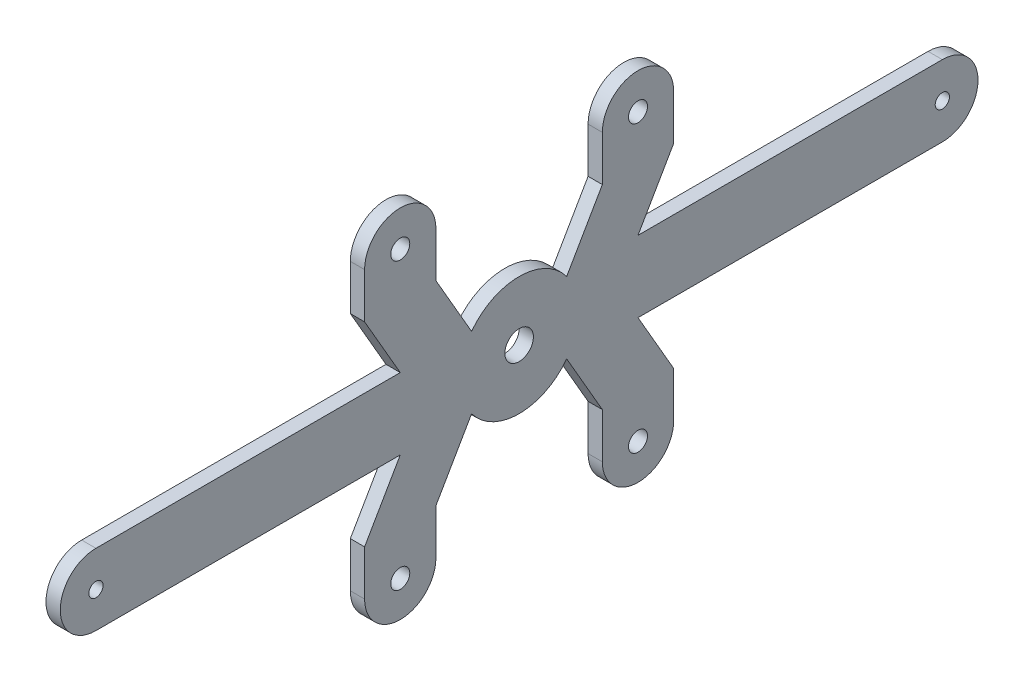
ISO-10303-21;
HEADER;
FILE_DESCRIPTION(('STEP AP214'),'2;1');
FILE_NAME('part.step','',(''),(''),'','','');
FILE_SCHEMA(('AUTOMOTIVE_DESIGN { 1 0 10303 214 1 1 1 1 }'));
ENDSEC;
DATA;
#1=APPLICATION_CONTEXT('core data for automotive mechanical design processes');
#2=APPLICATION_PROTOCOL_DEFINITION('international standard','automotive_design',2000,#1);
#3=PRODUCT_CONTEXT('',#1,'mechanical');
#4=PRODUCT('Part','Part','',(#3));
#5=PRODUCT_RELATED_PRODUCT_CATEGORY('part','',(#4));
#6=PRODUCT_DEFINITION_FORMATION('','',#4);
#7=PRODUCT_DEFINITION_CONTEXT('part definition',#1,'design');
#8=PRODUCT_DEFINITION('design','',#6,#7);
#9=PRODUCT_DEFINITION_SHAPE('','',#8);
#10=(LENGTH_UNIT() NAMED_UNIT(*) SI_UNIT(.MILLI.,.METRE.));
#11=(NAMED_UNIT(*) PLANE_ANGLE_UNIT() SI_UNIT($,.RADIAN.));
#12=(NAMED_UNIT(*) SI_UNIT($,.STERADIAN.) SOLID_ANGLE_UNIT());
#13=UNCERTAINTY_MEASURE_WITH_UNIT(LENGTH_MEASURE(1.E-05),#10,'distance_accuracy_value','');
#14=(GEOMETRIC_REPRESENTATION_CONTEXT(3) GLOBAL_UNCERTAINTY_ASSIGNED_CONTEXT((#13)) GLOBAL_UNIT_ASSIGNED_CONTEXT((#10,
#11,#12)) REPRESENTATION_CONTEXT('',''));
#15=CARTESIAN_POINT('',(0.,0.,0.));
#16=DIRECTION('',(0.,0.,1.));
#17=DIRECTION('',(1.,0.,0.));
#18=AXIS2_PLACEMENT_3D('',#15,#16,#17);
#19=CARTESIAN_POINT('',(3.,0.,0.));
#20=DIRECTION('',(1.,0.,0.));
#21=DIRECTION('',(0.,0.,-1.));
#22=AXIS2_PLACEMENT_3D('',#19,#20,#21);
#23=PLANE('',#22);
#24=CARTESIAN_POINT('',(3.,0.,0.));
#25=DIRECTION('',(1.,0.,0.));
#26=DIRECTION('',(0.,0.,-1.));
#27=AXIS2_PLACEMENT_3D('',#24,#25,#26);
#28=CIRCLE('',#27,3.);
#29=CARTESIAN_POINT('',(3.,0.,-3.));
#30=VERTEX_POINT('',#29);
#31=EDGE_CURVE('E559',#30,#30,#28,.T.);
#32=ORIENTED_EDGE('',*,*,#31,.F.);
#33=EDGE_LOOP('',(#32));
#34=FACE_BOUND('',#33,.T.);
#35=CARTESIAN_POINT('',(3.,30.,25.));
#36=DIRECTION('',(1.,0.,0.));
#37=DIRECTION('',(0.,0.,-1.));
#38=AXIS2_PLACEMENT_3D('',#35,#36,#37);
#39=CIRCLE('',#38,2.00000000000001);
#40=CARTESIAN_POINT('',(3.,30.,23.));
#41=VERTEX_POINT('',#40);
#42=EDGE_CURVE('E156',#41,#41,#39,.T.);
#43=ORIENTED_EDGE('',*,*,#42,.F.);
#44=EDGE_LOOP('',(#43));
#45=FACE_BOUND('',#44,.T.);
#46=CARTESIAN_POINT('',(3.,0.,89.));
#47=DIRECTION('',(1.,0.,0.));
#48=DIRECTION('',(0.,0.,-1.));
#49=AXIS2_PLACEMENT_3D('',#46,#47,#48);
#50=CIRCLE('',#49,1.5);
#51=CARTESIAN_POINT('',(3.,0.,87.5));
#52=VERTEX_POINT('',#51);
#53=EDGE_CURVE('E43',#52,#52,#50,.T.);
#54=ORIENTED_EDGE('',*,*,#53,.F.);
#55=EDGE_LOOP('',(#54));
#56=FACE_BOUND('',#55,.T.);
#57=CARTESIAN_POINT('',(3.,-30.,25.));
#58=DIRECTION('',(-1.,0.,0.));
#59=DIRECTION('',(0.,0.,-1.));
#60=AXIS2_PLACEMENT_3D('',#57,#58,#59);
#61=CIRCLE('',#60,2.00000000000001);
#62=CARTESIAN_POINT('',(3.,-30.,23.));
#63=VERTEX_POINT('',#62);
#64=EDGE_CURVE('E181',#63,#63,#61,.T.);
#65=ORIENTED_EDGE('',*,*,#64,.T.);
#66=EDGE_LOOP('',(#65));
#67=FACE_BOUND('',#66,.T.);
#68=CARTESIAN_POINT('',(3.,0.,-89.));
#69=DIRECTION('',(-1.,0.,0.));
#70=DIRECTION('',(0.,0.,1.));
#71=AXIS2_PLACEMENT_3D('',#68,#69,#70);
#72=CIRCLE('',#71,1.5);
#73=CARTESIAN_POINT('',(3.,0.,-87.5));
#74=VERTEX_POINT('',#73);
#75=EDGE_CURVE('E185',#74,#74,#72,.T.);
#76=ORIENTED_EDGE('',*,*,#75,.T.);
#77=EDGE_LOOP('',(#76));
#78=FACE_BOUND('',#77,.T.);
#79=CARTESIAN_POINT('',(3.,30.,-25.));
#80=DIRECTION('',(-1.,0.,0.));
#81=DIRECTION('',(0.,0.,1.));
#82=AXIS2_PLACEMENT_3D('',#79,#80,#81);
#83=CIRCLE('',#82,2.00000000000001);
#84=CARTESIAN_POINT('',(3.,30.,-23.));
#85=VERTEX_POINT('',#84);
#86=EDGE_CURVE('E189',#85,#85,#83,.T.);
#87=ORIENTED_EDGE('',*,*,#86,.T.);
#88=EDGE_LOOP('',(#87));
#89=FACE_BOUND('',#88,.T.);
#90=CARTESIAN_POINT('',(3.,-30.,-25.));
#91=DIRECTION('',(1.,0.,0.));
#92=DIRECTION('',(0.,0.,1.));
#93=AXIS2_PLACEMENT_3D('',#90,#91,#92);
#94=CIRCLE('',#93,2.00000000000001);
#95=CARTESIAN_POINT('',(3.,-30.,-23.));
#96=VERTEX_POINT('',#95);
#97=EDGE_CURVE('E193',#96,#96,#94,.T.);
#98=ORIENTED_EDGE('',*,*,#97,.F.);
#99=EDGE_LOOP('',(#98));
#100=FACE_BOUND('',#99,.T.);
#101=DIRECTION('',(0.,0.,1.));
#102=VECTOR('',#101,1.);
#103=CARTESIAN_POINT('',(3.,-7.5,-89.));
#104=LINE('',#103,#102);
#105=CARTESIAN_POINT('',(3.,-7.5,-89.));
#106=VERTEX_POINT('',#105);
#107=CARTESIAN_POINT('',(3.,-7.5,-25.));
#108=VERTEX_POINT('',#107);
#109=EDGE_CURVE('E199',#106,#108,#104,.T.);
#110=ORIENTED_EDGE('',*,*,#109,.F.);
#111=CARTESIAN_POINT('',(3.,0.,-89.));
#112=DIRECTION('',(1.,0.,0.));
#113=DIRECTION('',(0.,0.,1.));
#114=AXIS2_PLACEMENT_3D('',#111,#112,#113);
#115=CIRCLE('',#114,7.5);
#116=CARTESIAN_POINT('',(3.,7.5,-89.));
#117=VERTEX_POINT('',#116);
#118=EDGE_CURVE('E203',#106,#117,#115,.T.);
#119=ORIENTED_EDGE('',*,*,#118,.T.);
#120=DIRECTION('',(0.,0.,1.));
#121=VECTOR('',#120,1.);
#122=CARTESIAN_POINT('',(3.,7.5,-89.));
#123=LINE('',#122,#121);
#124=CARTESIAN_POINT('',(3.,7.5,-25.));
#125=VERTEX_POINT('',#124);
#126=EDGE_CURVE('E293',#117,#125,#123,.T.);
#127=ORIENTED_EDGE('',*,*,#126,.T.);
#128=DIRECTION('',(0.,0.86602540378444,-0.499999999999998));
#129=VECTOR('',#128,1.);
#130=CARTESIAN_POINT('',(3.,20.4903810567666,-32.5));
#131=LINE('',#130,#129);
#132=CARTESIAN_POINT('',(3.,20.4903810567666,-32.5));
#133=VERTEX_POINT('',#132);
#134=EDGE_CURVE('E290',#125,#133,#131,.T.);
#135=ORIENTED_EDGE('',*,*,#134,.T.);
#136=DIRECTION('',(0.,1.,0.));
#137=VECTOR('',#136,1.);
#138=CARTESIAN_POINT('',(3.,29.9999999999999,-32.5));
#139=LINE('',#138,#137);
#140=CARTESIAN_POINT('',(3.,30.,-32.5));
#141=VERTEX_POINT('',#140);
#142=EDGE_CURVE('E287',#133,#141,#139,.T.);
#143=ORIENTED_EDGE('',*,*,#142,.T.);
#144=CARTESIAN_POINT('',(3.,30.,-25.));
#145=DIRECTION('',(1.,0.,0.));
#146=DIRECTION('',(0.,0.,1.));
#147=AXIS2_PLACEMENT_3D('',#144,#145,#146);
#148=CIRCLE('',#147,7.5);
#149=CARTESIAN_POINT('',(3.,30.,-17.5));
#150=VERTEX_POINT('',#149);
#151=EDGE_CURVE('E284',#141,#150,#148,.T.);
#152=ORIENTED_EDGE('',*,*,#151,.T.);
#153=DIRECTION('',(0.,-1.,0.));
#154=VECTOR('',#153,1.);
#155=CARTESIAN_POINT('',(3.,30.,-17.5));
#156=LINE('',#155,#154);
#157=CARTESIAN_POINT('',(3.,20.4903810567666,-17.5));
#158=VERTEX_POINT('',#157);
#159=EDGE_CURVE('E281',#150,#158,#156,.T.);
#160=ORIENTED_EDGE('',*,*,#159,.T.);
#161=DIRECTION('',(0.,-0.86602540378444,0.499999999999998));
#162=VECTOR('',#161,1.);
#163=CARTESIAN_POINT('',(3.,20.4903810567666,-17.5));
#164=LINE('',#163,#162);
#165=CARTESIAN_POINT('',(3.,7.5,-10.));
#166=VERTEX_POINT('',#165);
#167=EDGE_CURVE('E255',#158,#166,#164,.T.);
#168=ORIENTED_EDGE('',*,*,#167,.T.);
#169=CARTESIAN_POINT('',(3.,0.,0.));
#170=DIRECTION('',(-1.,0.,0.));
#171=DIRECTION('',(0.,0.,-1.));
#172=AXIS2_PLACEMENT_3D('',#169,#170,#171);
#173=CIRCLE('',#172,12.5);
#174=CARTESIAN_POINT('',(3.,7.5,10.));
#175=VERTEX_POINT('',#174);
#176=EDGE_CURVE('E136',#175,#166,#173,.T.);
#177=ORIENTED_EDGE('',*,*,#176,.F.);
#178=DIRECTION('',(0.,-0.86602540378444,-0.499999999999998));
#179=VECTOR('',#178,1.);
#180=CARTESIAN_POINT('',(3.,20.4903810567666,17.5));
#181=LINE('',#180,#179);
#182=CARTESIAN_POINT('',(3.,20.4903810567666,17.5));
#183=VERTEX_POINT('',#182);
#184=EDGE_CURVE('E134',#183,#175,#181,.T.);
#185=ORIENTED_EDGE('',*,*,#184,.F.);
#186=DIRECTION('',(0.,-1.,0.));
#187=VECTOR('',#186,1.);
#188=CARTESIAN_POINT('',(3.,30.,17.5));
#189=LINE('',#188,#187);
#190=CARTESIAN_POINT('',(3.,30.,17.5));
#191=VERTEX_POINT('',#190);
#192=EDGE_CURVE('E152',#191,#183,#189,.T.);
#193=ORIENTED_EDGE('',*,*,#192,.F.);
#194=CARTESIAN_POINT('',(3.,30.,25.));
#195=DIRECTION('',(-1.,0.,0.));
#196=DIRECTION('',(0.,0.,-1.));
#197=AXIS2_PLACEMENT_3D('',#194,#195,#196);
#198=CIRCLE('',#197,7.5);
#199=CARTESIAN_POINT('',(3.,30.,32.5));
#200=VERTEX_POINT('',#199);
#201=EDGE_CURVE('E150',#200,#191,#198,.T.);
#202=ORIENTED_EDGE('',*,*,#201,.F.);
#203=DIRECTION('',(0.,1.,0.));
#204=VECTOR('',#203,1.);
#205=CARTESIAN_POINT('',(3.,29.9999999999999,32.5));
#206=LINE('',#205,#204);
#207=CARTESIAN_POINT('',(3.,20.4903810567666,32.5));
#208=VERTEX_POINT('',#207);
#209=EDGE_CURVE('E112',#208,#200,#206,.T.);
#210=ORIENTED_EDGE('',*,*,#209,.F.);
#211=DIRECTION('',(0.,0.86602540378444,0.499999999999998));
#212=VECTOR('',#211,1.);
#213=CARTESIAN_POINT('',(3.,20.4903810567666,32.5));
#214=LINE('',#213,#212);
#215=CARTESIAN_POINT('',(3.,7.5,25.));
#216=VERTEX_POINT('',#215);
#217=EDGE_CURVE('E146',#216,#208,#214,.T.);
#218=ORIENTED_EDGE('',*,*,#217,.F.);
#219=DIRECTION('',(0.,0.,-1.));
#220=VECTOR('',#219,1.);
#221=CARTESIAN_POINT('',(3.,7.5,89.));
#222=LINE('',#221,#220);
#223=CARTESIAN_POINT('',(3.,7.5,89.));
#224=VERTEX_POINT('',#223);
#225=EDGE_CURVE('E143',#224,#216,#222,.T.);
#226=ORIENTED_EDGE('',*,*,#225,.F.);
#227=CARTESIAN_POINT('',(3.,0.,89.));
#228=DIRECTION('',(-1.,0.,0.));
#229=DIRECTION('',(0.,0.,-1.));
#230=AXIS2_PLACEMENT_3D('',#227,#228,#229);
#231=CIRCLE('',#230,7.5);
#232=CARTESIAN_POINT('',(3.,-7.5,89.));
#233=VERTEX_POINT('',#232);
#234=EDGE_CURVE('E140',#233,#224,#231,.T.);
#235=ORIENTED_EDGE('',*,*,#234,.F.);
#236=DIRECTION('',(0.,0.,-1.));
#237=VECTOR('',#236,1.);
#238=CARTESIAN_POINT('',(3.,-7.5,89.));
#239=LINE('',#238,#237);
#240=CARTESIAN_POINT('',(3.,-7.5,25.));
#241=VERTEX_POINT('',#240);
#242=EDGE_CURVE('E362',#233,#241,#239,.T.);
#243=ORIENTED_EDGE('',*,*,#242,.T.);
#244=DIRECTION('',(0.,-0.86602540378444,0.499999999999998));
#245=VECTOR('',#244,1.);
#246=CARTESIAN_POINT('',(3.,-20.4903810567666,32.5));
#247=LINE('',#246,#245);
#248=CARTESIAN_POINT('',(3.,-20.4903810567666,32.5));
#249=VERTEX_POINT('',#248);
#250=EDGE_CURVE('E359',#241,#249,#247,.T.);
#251=ORIENTED_EDGE('',*,*,#250,.T.);
#252=DIRECTION('',(0.,-1.,0.));
#253=VECTOR('',#252,1.);
#254=CARTESIAN_POINT('',(3.,-29.9999999999999,32.5));
#255=LINE('',#254,#253);
#256=CARTESIAN_POINT('',(3.,-30.,32.5));
#257=VERTEX_POINT('',#256);
#258=EDGE_CURVE('E356',#249,#257,#255,.T.);
#259=ORIENTED_EDGE('',*,*,#258,.T.);
#260=CARTESIAN_POINT('',(3.,-30.,25.));
#261=DIRECTION('',(1.,0.,0.));
#262=DIRECTION('',(0.,0.,-1.));
#263=AXIS2_PLACEMENT_3D('',#260,#261,#262);
#264=CIRCLE('',#263,7.5);
#265=CARTESIAN_POINT('',(3.,-30.,17.5));
#266=VERTEX_POINT('',#265);
#267=EDGE_CURVE('E353',#257,#266,#264,.T.);
#268=ORIENTED_EDGE('',*,*,#267,.T.);
#269=DIRECTION('',(0.,1.,0.));
#270=VECTOR('',#269,1.);
#271=CARTESIAN_POINT('',(3.,-30.,17.5));
#272=LINE('',#271,#270);
#273=CARTESIAN_POINT('',(3.,-20.4903810567666,17.5));
#274=VERTEX_POINT('',#273);
#275=EDGE_CURVE('E350',#266,#274,#272,.T.);
#276=ORIENTED_EDGE('',*,*,#275,.T.);
#277=DIRECTION('',(0.,0.86602540378444,-0.499999999999998));
#278=VECTOR('',#277,1.);
#279=CARTESIAN_POINT('',(3.,-20.4903810567666,17.5));
#280=LINE('',#279,#278);
#281=CARTESIAN_POINT('',(3.,-7.5,10.));
#282=VERTEX_POINT('',#281);
#283=EDGE_CURVE('E323',#274,#282,#280,.T.);
#284=ORIENTED_EDGE('',*,*,#283,.T.);
#285=CARTESIAN_POINT('',(3.,0.,0.));
#286=DIRECTION('',(1.,0.,0.));
#287=DIRECTION('',(0.,0.,-1.));
#288=AXIS2_PLACEMENT_3D('',#285,#286,#287);
#289=CIRCLE('',#288,12.5);
#290=CARTESIAN_POINT('',(3.,-7.5,-10.));
#291=VERTEX_POINT('',#290);
#292=EDGE_CURVE('E329',#282,#291,#289,.T.);
#293=ORIENTED_EDGE('',*,*,#292,.T.);
#294=DIRECTION('',(0.,0.86602540378444,0.499999999999998));
#295=VECTOR('',#294,1.);
#296=CARTESIAN_POINT('',(3.,-20.4903810567666,-17.5));
#297=LINE('',#296,#295);
#298=CARTESIAN_POINT('',(3.,-20.4903810567666,-17.5));
#299=VERTEX_POINT('',#298);
#300=EDGE_CURVE('E213',#299,#291,#297,.T.);
#301=ORIENTED_EDGE('',*,*,#300,.F.);
#302=DIRECTION('',(0.,1.,0.));
#303=VECTOR('',#302,1.);
#304=CARTESIAN_POINT('',(3.,-30.,-17.5));
#305=LINE('',#304,#303);
#306=CARTESIAN_POINT('',(3.,-30.,-17.5));
#307=VERTEX_POINT('',#306);
#308=EDGE_CURVE('E227',#307,#299,#305,.T.);
#309=ORIENTED_EDGE('',*,*,#308,.F.);
#310=CARTESIAN_POINT('',(3.,-30.,-25.));
#311=DIRECTION('',(-1.,0.,0.));
#312=DIRECTION('',(0.,0.,1.));
#313=AXIS2_PLACEMENT_3D('',#310,#311,#312);
#314=CIRCLE('',#313,7.5);
#315=CARTESIAN_POINT('',(3.,-30.,-32.5));
#316=VERTEX_POINT('',#315);
#317=EDGE_CURVE('E224',#316,#307,#314,.T.);
#318=ORIENTED_EDGE('',*,*,#317,.F.);
#319=DIRECTION('',(0.,-1.,0.));
#320=VECTOR('',#319,1.);
#321=CARTESIAN_POINT('',(3.,-29.9999999999999,-32.5));
#322=LINE('',#321,#320);
#323=CARTESIAN_POINT('',(3.,-20.4903810567666,-32.5));
#324=VERTEX_POINT('',#323);
#325=EDGE_CURVE('E215',#324,#316,#322,.T.);
#326=ORIENTED_EDGE('',*,*,#325,.F.);
#327=DIRECTION('',(0.,-0.86602540378444,-0.499999999999998));
#328=VECTOR('',#327,1.);
#329=CARTESIAN_POINT('',(3.,-20.4903810567666,-32.5));
#330=LINE('',#329,#328);
#331=EDGE_CURVE('E207',#108,#324,#330,.T.);
#332=ORIENTED_EDGE('',*,*,#331,.F.);
#333=EDGE_LOOP('',(#110,#119,#127,#135,#143,#152,#160,#168,#177,#185,#193,#202,#210,#218,#226,
#235,#243,#251,#259,#268,#276,#284,#293,#301,#309,#318,#326,#332));
#334=FACE_BOUND('',#333,.T.);
#335=ADVANCED_FACE('F39',(#34,#45,#56,#67,#78,#89,#100,#334),#23,.T.);
#336=CARTESIAN_POINT('',(0.,0.,0.));
#337=DIRECTION('',(1.,0.,0.));
#338=DIRECTION('',(0.,0.,-1.));
#339=AXIS2_PLACEMENT_3D('',#336,#337,#338);
#340=PLANE('',#339);
#341=CARTESIAN_POINT('',(0.,0.,0.));
#342=DIRECTION('',(1.,0.,0.));
#343=DIRECTION('',(0.,0.,-1.));
#344=AXIS2_PLACEMENT_3D('',#341,#342,#343);
#345=CIRCLE('',#344,3.);
#346=CARTESIAN_POINT('',(0.,0.,-3.));
#347=VERTEX_POINT('',#346);
#348=EDGE_CURVE('E218',#347,#347,#345,.T.);
#349=ORIENTED_EDGE('',*,*,#348,.T.);
#350=EDGE_LOOP('',(#349));
#351=FACE_BOUND('',#350,.T.);
#352=CARTESIAN_POINT('',(0.,-30.,-25.));
#353=DIRECTION('',(1.,0.,0.));
#354=DIRECTION('',(0.,0.,1.));
#355=AXIS2_PLACEMENT_3D('',#352,#353,#354);
#356=CIRCLE('',#355,2.00000000000001);
#357=CARTESIAN_POINT('',(0.,-30.,-23.));
#358=VERTEX_POINT('',#357);
#359=EDGE_CURVE('E252',#358,#358,#356,.T.);
#360=ORIENTED_EDGE('',*,*,#359,.T.);
#361=EDGE_LOOP('',(#360));
#362=FACE_BOUND('',#361,.T.);
#363=CARTESIAN_POINT('',(0.,-30.,25.));
#364=DIRECTION('',(-1.,0.,0.));
#365=DIRECTION('',(0.,0.,-1.));
#366=AXIS2_PLACEMENT_3D('',#363,#364,#365);
#367=CIRCLE('',#366,2.00000000000001);
#368=CARTESIAN_POINT('',(0.,-30.,23.));
#369=VERTEX_POINT('',#368);
#370=EDGE_CURVE('E137',#369,#369,#367,.T.);
#371=ORIENTED_EDGE('',*,*,#370,.F.);
#372=EDGE_LOOP('',(#371));
#373=FACE_BOUND('',#372,.T.);
#374=CARTESIAN_POINT('',(0.,30.,25.));
#375=DIRECTION('',(1.,0.,0.));
#376=DIRECTION('',(0.,0.,-1.));
#377=AXIS2_PLACEMENT_3D('',#374,#375,#376);
#378=CIRCLE('',#377,2.00000000000001);
#379=CARTESIAN_POINT('',(0.,30.,23.));
#380=VERTEX_POINT('',#379);
#381=EDGE_CURVE('E164',#380,#380,#378,.T.);
#382=ORIENTED_EDGE('',*,*,#381,.T.);
#383=EDGE_LOOP('',(#382));
#384=FACE_BOUND('',#383,.T.);
#385=CARTESIAN_POINT('',(0.,0.,89.));
#386=DIRECTION('',(1.,0.,0.));
#387=DIRECTION('',(0.,0.,-1.));
#388=AXIS2_PLACEMENT_3D('',#385,#386,#387);
#389=CIRCLE('',#388,1.5);
#390=CARTESIAN_POINT('',(0.,0.,87.5));
#391=VERTEX_POINT('',#390);
#392=EDGE_CURVE('E11',#391,#391,#389,.T.);
#393=ORIENTED_EDGE('',*,*,#392,.T.);
#394=EDGE_LOOP('',(#393));
#395=FACE_BOUND('',#394,.T.);
#396=CARTESIAN_POINT('',(0.,0.,-89.));
#397=DIRECTION('',(-1.,0.,0.));
#398=DIRECTION('',(0.,0.,1.));
#399=AXIS2_PLACEMENT_3D('',#396,#397,#398);
#400=CIRCLE('',#399,1.5);
#401=CARTESIAN_POINT('',(0.,0.,-87.5));
#402=VERTEX_POINT('',#401);
#403=EDGE_CURVE('E320',#402,#402,#400,.T.);
#404=ORIENTED_EDGE('',*,*,#403,.F.);
#405=EDGE_LOOP('',(#404));
#406=FACE_BOUND('',#405,.T.);
#407=CARTESIAN_POINT('',(0.,30.,-25.));
#408=DIRECTION('',(-1.,0.,0.));
#409=DIRECTION('',(0.,0.,1.));
#410=AXIS2_PLACEMENT_3D('',#407,#408,#409);
#411=CIRCLE('',#410,2.00000000000001);
#412=CARTESIAN_POINT('',(0.,30.,-23.));
#413=VERTEX_POINT('',#412);
#414=EDGE_CURVE('E316',#413,#413,#411,.T.);
#415=ORIENTED_EDGE('',*,*,#414,.F.);
#416=EDGE_LOOP('',(#415));
#417=FACE_BOUND('',#416,.T.);
#418=CARTESIAN_POINT('',(0.,0.,-89.));
#419=DIRECTION('',(1.,0.,0.));
#420=DIRECTION('',(0.,0.,1.));
#421=AXIS2_PLACEMENT_3D('',#418,#419,#420);
#422=CIRCLE('',#421,7.5);
#423=CARTESIAN_POINT('',(0.,-7.5,-89.));
#424=VERTEX_POINT('',#423);
#425=CARTESIAN_POINT('',(0.,7.5,-89.));
#426=VERTEX_POINT('',#425);
#427=EDGE_CURVE('E275',#424,#426,#422,.T.);
#428=ORIENTED_EDGE('',*,*,#427,.F.);
#429=DIRECTION('',(0.,0.,1.));
#430=VECTOR('',#429,1.);
#431=CARTESIAN_POINT('',(0.,-7.5,-89.));
#432=LINE('',#431,#430);
#433=CARTESIAN_POINT('',(0.,-7.5,-25.));
#434=VERTEX_POINT('',#433);
#435=EDGE_CURVE('E553',#424,#434,#432,.T.);
#436=ORIENTED_EDGE('',*,*,#435,.T.);
#437=DIRECTION('',(0.,-0.86602540378444,-0.499999999999998));
#438=VECTOR('',#437,1.);
#439=CARTESIAN_POINT('',(0.,-20.4903810567666,-32.5));
#440=LINE('',#439,#438);
#441=CARTESIAN_POINT('',(0.,-20.4903810567666,-32.5));
#442=VERTEX_POINT('',#441);
#443=EDGE_CURVE('E556',#434,#442,#440,.T.);
#444=ORIENTED_EDGE('',*,*,#443,.T.);
#445=DIRECTION('',(0.,-1.,0.));
#446=VECTOR('',#445,1.);
#447=CARTESIAN_POINT('',(0.,-29.9999999999999,-32.5));
#448=LINE('',#447,#446);
#449=CARTESIAN_POINT('',(0.,-30.,-32.5));
#450=VERTEX_POINT('',#449);
#451=EDGE_CURVE('E564',#442,#450,#448,.T.);
#452=ORIENTED_EDGE('',*,*,#451,.T.);
#453=CARTESIAN_POINT('',(0.,-30.,-25.));
#454=DIRECTION('',(-1.,0.,0.));
#455=DIRECTION('',(0.,0.,1.));
#456=AXIS2_PLACEMENT_3D('',#453,#454,#455);
#457=CIRCLE('',#456,7.5);
#458=CARTESIAN_POINT('',(0.,-30.,-17.5));
#459=VERTEX_POINT('',#458);
#460=EDGE_CURVE('E567',#450,#459,#457,.T.);
#461=ORIENTED_EDGE('',*,*,#460,.T.);
#462=DIRECTION('',(0.,1.,0.));
#463=VECTOR('',#462,1.);
#464=CARTESIAN_POINT('',(0.,-30.,-17.5));
#465=LINE('',#464,#463);
#466=CARTESIAN_POINT('',(0.,-20.4903810567666,-17.5));
#467=VERTEX_POINT('',#466);
#468=EDGE_CURVE('E251',#459,#467,#465,.T.);
#469=ORIENTED_EDGE('',*,*,#468,.T.);
#470=DIRECTION('',(0.,0.86602540378444,0.499999999999998));
#471=VECTOR('',#470,1.);
#472=CARTESIAN_POINT('',(0.,-20.4903810567666,-17.5));
#473=LINE('',#472,#471);
#474=CARTESIAN_POINT('',(0.,-7.5,-10.));
#475=VERTEX_POINT('',#474);
#476=EDGE_CURVE('E230',#467,#475,#473,.T.);
#477=ORIENTED_EDGE('',*,*,#476,.T.);
#478=CARTESIAN_POINT('',(0.,0.,0.));
#479=DIRECTION('',(1.,0.,0.));
#480=DIRECTION('',(0.,0.,-1.));
#481=AXIS2_PLACEMENT_3D('',#478,#479,#480);
#482=CIRCLE('',#481,12.5);
#483=CARTESIAN_POINT('',(0.,-7.5,10.));
#484=VERTEX_POINT('',#483);
#485=EDGE_CURVE('E344',#484,#475,#482,.T.);
#486=ORIENTED_EDGE('',*,*,#485,.F.);
#487=DIRECTION('',(0.,0.86602540378444,-0.499999999999998));
#488=VECTOR('',#487,1.);
#489=CARTESIAN_POINT('',(0.,-20.4903810567666,17.5));
#490=LINE('',#489,#488);
#491=CARTESIAN_POINT('',(0.,-20.4903810567666,17.5));
#492=VERTEX_POINT('',#491);
#493=EDGE_CURVE('E325',#492,#484,#490,.T.);
#494=ORIENTED_EDGE('',*,*,#493,.F.);
#495=DIRECTION('',(0.,1.,0.));
#496=VECTOR('',#495,1.);
#497=CARTESIAN_POINT('',(0.,-30.,17.5));
#498=LINE('',#497,#496);
#499=CARTESIAN_POINT('',(0.,-30.,17.5));
#500=VERTEX_POINT('',#499);
#501=EDGE_CURVE('E328',#500,#492,#498,.T.);
#502=ORIENTED_EDGE('',*,*,#501,.F.);
#503=CARTESIAN_POINT('',(0.,-30.,25.));
#504=DIRECTION('',(1.,0.,0.));
#505=DIRECTION('',(0.,0.,-1.));
#506=AXIS2_PLACEMENT_3D('',#503,#504,#505);
#507=CIRCLE('',#506,7.5);
#508=CARTESIAN_POINT('',(0.,-30.,32.5));
#509=VERTEX_POINT('',#508);
#510=EDGE_CURVE('E332',#509,#500,#507,.T.);
#511=ORIENTED_EDGE('',*,*,#510,.F.);
#512=DIRECTION('',(0.,-1.,0.));
#513=VECTOR('',#512,1.);
#514=CARTESIAN_POINT('',(0.,-29.9999999999999,32.5));
#515=LINE('',#514,#513);
#516=CARTESIAN_POINT('',(0.,-20.4903810567666,32.5));
#517=VERTEX_POINT('',#516);
#518=EDGE_CURVE('E335',#517,#509,#515,.T.);
#519=ORIENTED_EDGE('',*,*,#518,.F.);
#520=DIRECTION('',(0.,-0.86602540378444,0.499999999999998));
#521=VECTOR('',#520,1.);
#522=CARTESIAN_POINT('',(0.,-20.4903810567666,32.5));
#523=LINE('',#522,#521);
#524=CARTESIAN_POINT('',(0.,-7.5,25.));
#525=VERTEX_POINT('',#524);
#526=EDGE_CURVE('E338',#525,#517,#523,.T.);
#527=ORIENTED_EDGE('',*,*,#526,.F.);
#528=DIRECTION('',(0.,0.,-1.));
#529=VECTOR('',#528,1.);
#530=CARTESIAN_POINT('',(0.,-7.5,89.));
#531=LINE('',#530,#529);
#532=CARTESIAN_POINT('',(0.,-7.5,89.));
#533=VERTEX_POINT('',#532);
#534=EDGE_CURVE('E341',#533,#525,#531,.T.);
#535=ORIENTED_EDGE('',*,*,#534,.F.);
#536=CARTESIAN_POINT('',(0.,0.,89.));
#537=DIRECTION('',(-1.,0.,0.));
#538=DIRECTION('',(0.,0.,-1.));
#539=AXIS2_PLACEMENT_3D('',#536,#537,#538);
#540=CIRCLE('',#539,7.5);
#541=CARTESIAN_POINT('',(0.,7.5,89.));
#542=VERTEX_POINT('',#541);
#543=EDGE_CURVE('E395',#533,#542,#540,.T.);
#544=ORIENTED_EDGE('',*,*,#543,.T.);
#545=DIRECTION('',(0.,0.,-1.));
#546=VECTOR('',#545,1.);
#547=CARTESIAN_POINT('',(0.,7.5,89.));
#548=LINE('',#547,#546);
#549=CARTESIAN_POINT('',(0.,7.5,25.));
#550=VERTEX_POINT('',#549);
#551=EDGE_CURVE('E129',#542,#550,#548,.T.);
#552=ORIENTED_EDGE('',*,*,#551,.T.);
#553=DIRECTION('',(0.,0.86602540378444,0.499999999999998));
#554=VECTOR('',#553,1.);
#555=CARTESIAN_POINT('',(0.,20.4903810567666,32.5));
#556=LINE('',#555,#554);
#557=CARTESIAN_POINT('',(0.,20.4903810567666,32.5));
#558=VERTEX_POINT('',#557);
#559=EDGE_CURVE('E127',#550,#558,#556,.T.);
#560=ORIENTED_EDGE('',*,*,#559,.T.);
#561=DIRECTION('',(0.,1.,0.));
#562=VECTOR('',#561,1.);
#563=CARTESIAN_POINT('',(0.,29.9999999999999,32.5));
#564=LINE('',#563,#562);
#565=CARTESIAN_POINT('',(0.,30.,32.5));
#566=VERTEX_POINT('',#565);
#567=EDGE_CURVE('E109',#558,#566,#564,.T.);
#568=ORIENTED_EDGE('',*,*,#567,.T.);
#569=CARTESIAN_POINT('',(0.,30.,25.));
#570=DIRECTION('',(-1.,0.,0.));
#571=DIRECTION('',(0.,0.,-1.));
#572=AXIS2_PLACEMENT_3D('',#569,#570,#571);
#573=CIRCLE('',#572,7.5);
#574=CARTESIAN_POINT('',(0.,30.,17.5));
#575=VERTEX_POINT('',#574);
#576=EDGE_CURVE('E118',#566,#575,#573,.T.);
#577=ORIENTED_EDGE('',*,*,#576,.T.);
#578=DIRECTION('',(0.,-1.,0.));
#579=VECTOR('',#578,1.);
#580=CARTESIAN_POINT('',(0.,30.,17.5));
#581=LINE('',#580,#579);
#582=CARTESIAN_POINT('',(0.,20.4903810567666,17.5));
#583=VERTEX_POINT('',#582);
#584=EDGE_CURVE('E122',#575,#583,#581,.T.);
#585=ORIENTED_EDGE('',*,*,#584,.T.);
#586=DIRECTION('',(0.,-0.86602540378444,-0.499999999999998));
#587=VECTOR('',#586,1.);
#588=CARTESIAN_POINT('',(0.,20.4903810567666,17.5));
#589=LINE('',#588,#587);
#590=CARTESIAN_POINT('',(0.,7.5,10.));
#591=VERTEX_POINT('',#590);
#592=EDGE_CURVE('E154',#583,#591,#589,.T.);
#593=ORIENTED_EDGE('',*,*,#592,.T.);
#594=CARTESIAN_POINT('',(0.,0.,0.));
#595=DIRECTION('',(-1.,0.,0.));
#596=DIRECTION('',(0.,0.,-1.));
#597=AXIS2_PLACEMENT_3D('',#594,#595,#596);
#598=CIRCLE('',#597,12.5);
#599=CARTESIAN_POINT('',(0.,7.5,-10.));
#600=VERTEX_POINT('',#599);
#601=EDGE_CURVE('E392',#591,#600,#598,.T.);
#602=ORIENTED_EDGE('',*,*,#601,.T.);
#603=DIRECTION('',(0.,-0.86602540378444,0.499999999999998));
#604=VECTOR('',#603,1.);
#605=CARTESIAN_POINT('',(0.,20.4903810567666,-17.5));
#606=LINE('',#605,#604);
#607=CARTESIAN_POINT('',(0.,20.4903810567666,-17.5));
#608=VERTEX_POINT('',#607);
#609=EDGE_CURVE('E257',#608,#600,#606,.T.);
#610=ORIENTED_EDGE('',*,*,#609,.F.);
#611=DIRECTION('',(0.,-1.,0.));
#612=VECTOR('',#611,1.);
#613=CARTESIAN_POINT('',(0.,30.,-17.5));
#614=LINE('',#613,#612);
#615=CARTESIAN_POINT('',(0.,30.,-17.5));
#616=VERTEX_POINT('',#615);
#617=EDGE_CURVE('E260',#616,#608,#614,.T.);
#618=ORIENTED_EDGE('',*,*,#617,.F.);
#619=CARTESIAN_POINT('',(0.,30.,-25.));
#620=DIRECTION('',(1.,0.,0.));
#621=DIRECTION('',(0.,0.,1.));
#622=AXIS2_PLACEMENT_3D('',#619,#620,#621);
#623=CIRCLE('',#622,7.5);
#624=CARTESIAN_POINT('',(0.,30.,-32.5));
#625=VERTEX_POINT('',#624);
#626=EDGE_CURVE('E263',#625,#616,#623,.T.);
#627=ORIENTED_EDGE('',*,*,#626,.F.);
#628=DIRECTION('',(0.,1.,0.));
#629=VECTOR('',#628,1.);
#630=CARTESIAN_POINT('',(0.,29.9999999999999,-32.5));
#631=LINE('',#630,#629);
#632=CARTESIAN_POINT('',(0.,20.4903810567666,-32.5));
#633=VERTEX_POINT('',#632);
#634=EDGE_CURVE('E266',#633,#625,#631,.T.);
#635=ORIENTED_EDGE('',*,*,#634,.F.);
#636=DIRECTION('',(0.,0.86602540378444,-0.499999999999998));
#637=VECTOR('',#636,1.);
#638=CARTESIAN_POINT('',(0.,20.4903810567666,-32.5));
#639=LINE('',#638,#637);
#640=CARTESIAN_POINT('',(0.,7.5,-25.));
#641=VERTEX_POINT('',#640);
#642=EDGE_CURVE('E269',#641,#633,#639,.T.);
#643=ORIENTED_EDGE('',*,*,#642,.F.);
#644=DIRECTION('',(0.,0.,1.));
#645=VECTOR('',#644,1.);
#646=CARTESIAN_POINT('',(0.,7.5,-89.));
#647=LINE('',#646,#645);
#648=EDGE_CURVE('E272',#426,#641,#647,.T.);
#649=ORIENTED_EDGE('',*,*,#648,.F.);
#650=EDGE_LOOP('',(#428,#436,#444,#452,#461,#469,#477,#486,#494,#502,#511,#519,#527,#535,#544,
#552,#560,#568,#577,#585,#593,#602,#610,#618,#627,#635,#643,#649));
#651=FACE_BOUND('',#650,.T.);
#652=ADVANCED_FACE('F41',(#351,#362,#373,#384,#395,#406,#417,#651),#340,.F.);
#653=CARTESIAN_POINT('',(0.,0.,89.));
#654=DIRECTION('',(1.,0.,0.));
#655=DIRECTION('',(0.,0.,-1.));
#656=AXIS2_PLACEMENT_3D('',#653,#654,#655);
#657=CYLINDRICAL_SURFACE('',#656,1.5);
#658=ORIENTED_EDGE('',*,*,#392,.F.);
#659=EDGE_LOOP('',(#658));
#660=FACE_BOUND('',#659,.T.);
#661=ORIENTED_EDGE('',*,*,#53,.T.);
#662=EDGE_LOOP('',(#661));
#663=FACE_BOUND('',#662,.T.);
#664=ADVANCED_FACE('F439',(#660,#663),#657,.F.);
#665=CARTESIAN_POINT('',(0.,30.,25.));
#666=DIRECTION('',(1.,0.,0.));
#667=DIRECTION('',(0.,0.,-1.));
#668=AXIS2_PLACEMENT_3D('',#665,#666,#667);
#669=CYLINDRICAL_SURFACE('',#668,2.00000000000001);
#670=ORIENTED_EDGE('',*,*,#381,.F.);
#671=EDGE_LOOP('',(#670));
#672=FACE_BOUND('',#671,.T.);
#673=ORIENTED_EDGE('',*,*,#42,.T.);
#674=EDGE_LOOP('',(#673));
#675=FACE_BOUND('',#674,.T.);
#676=ADVANCED_FACE('F170',(#672,#675),#669,.F.);
#677=CARTESIAN_POINT('',(0.,20.4903810567666,17.5));
#678=DIRECTION('',(0.,-0.499999999999998,0.86602540378444));
#679=DIRECTION('',(0.,-0.86602540378444,-0.499999999999998));
#680=AXIS2_PLACEMENT_3D('',#677,#678,#679);
#681=PLANE('',#680);
#682=ORIENTED_EDGE('',*,*,#184,.T.);
#683=DIRECTION('',(1.,0.,0.));
#684=VECTOR('',#683,1.);
#685=CARTESIAN_POINT('',(0.,7.5,10.));
#686=LINE('',#685,#684);
#687=EDGE_CURVE('E88',#591,#175,#686,.T.);
#688=ORIENTED_EDGE('',*,*,#687,.F.);
#689=ORIENTED_EDGE('',*,*,#592,.F.);
#690=DIRECTION('',(1.,0.,0.));
#691=VECTOR('',#690,1.);
#692=CARTESIAN_POINT('',(0.,20.4903810567666,17.5));
#693=LINE('',#692,#691);
#694=EDGE_CURVE('E56',#583,#183,#693,.T.);
#695=ORIENTED_EDGE('',*,*,#694,.T.);
#696=EDGE_LOOP('',(#682,#688,#689,#695));
#697=FACE_BOUND('',#696,.T.);
#698=ADVANCED_FACE('F411',(#697),#681,.F.);
#699=CARTESIAN_POINT('',(0.,30.,17.5));
#700=DIRECTION('',(0.,0.,1.));
#701=DIRECTION('',(0.,-1.,0.));
#702=AXIS2_PLACEMENT_3D('',#699,#700,#701);
#703=PLANE('',#702);
#704=ORIENTED_EDGE('',*,*,#192,.T.);
#705=ORIENTED_EDGE('',*,*,#694,.F.);
#706=ORIENTED_EDGE('',*,*,#584,.F.);
#707=DIRECTION('',(1.,0.,0.));
#708=VECTOR('',#707,1.);
#709=CARTESIAN_POINT('',(0.,30.,17.5));
#710=LINE('',#709,#708);
#711=EDGE_CURVE('E80',#575,#191,#710,.T.);
#712=ORIENTED_EDGE('',*,*,#711,.T.);
#713=EDGE_LOOP('',(#704,#705,#706,#712));
#714=FACE_BOUND('',#713,.T.);
#715=ADVANCED_FACE('F409',(#714),#703,.F.);
#716=CARTESIAN_POINT('',(0.,30.,25.));
#717=DIRECTION('',(1.,0.,0.));
#718=DIRECTION('',(0.,0.,-1.));
#719=AXIS2_PLACEMENT_3D('',#716,#717,#718);
#720=CYLINDRICAL_SURFACE('',#719,7.5);
#721=ORIENTED_EDGE('',*,*,#201,.T.);
#722=ORIENTED_EDGE('',*,*,#711,.F.);
#723=ORIENTED_EDGE('',*,*,#576,.F.);
#724=DIRECTION('',(1.,0.,0.));
#725=VECTOR('',#724,1.);
#726=CARTESIAN_POINT('',(0.,30.,32.5));
#727=LINE('',#726,#725);
#728=EDGE_CURVE('E105',#566,#200,#727,.T.);
#729=ORIENTED_EDGE('',*,*,#728,.T.);
#730=EDGE_LOOP('',(#721,#722,#723,#729));
#731=FACE_BOUND('',#730,.T.);
#732=ADVANCED_FACE('F119',(#731),#720,.T.);
#733=CARTESIAN_POINT('',(0.,29.9999999999999,32.5));
#734=DIRECTION('',(0.,0.,-1.));
#735=DIRECTION('',(-1.,0.,0.));
#736=AXIS2_PLACEMENT_3D('',#733,#734,#735);
#737=PLANE('',#736);
#738=ORIENTED_EDGE('',*,*,#209,.T.);
#739=ORIENTED_EDGE('',*,*,#728,.F.);
#740=ORIENTED_EDGE('',*,*,#567,.F.);
#741=DIRECTION('',(1.,0.,0.));
#742=VECTOR('',#741,1.);
#743=CARTESIAN_POINT('',(0.,20.4903810567666,32.5));
#744=LINE('',#743,#742);
#745=EDGE_CURVE('E115',#558,#208,#744,.T.);
#746=ORIENTED_EDGE('',*,*,#745,.T.);
#747=EDGE_LOOP('',(#738,#739,#740,#746));
#748=FACE_BOUND('',#747,.T.);
#749=ADVANCED_FACE('F107',(#748),#737,.F.);
#750=CARTESIAN_POINT('',(0.,20.4903810567666,32.5));
#751=DIRECTION('',(0.,0.499999999999998,-0.86602540378444));
#752=DIRECTION('',(0.,0.86602540378444,0.499999999999998));
#753=AXIS2_PLACEMENT_3D('',#750,#751,#752);
#754=PLANE('',#753);
#755=ORIENTED_EDGE('',*,*,#217,.T.);
#756=ORIENTED_EDGE('',*,*,#745,.F.);
#757=ORIENTED_EDGE('',*,*,#559,.F.);
#758=DIRECTION('',(1.,0.,0.));
#759=VECTOR('',#758,1.);
#760=CARTESIAN_POINT('',(0.,7.5,25.));
#761=LINE('',#760,#759);
#762=EDGE_CURVE('E159',#550,#216,#761,.T.);
#763=ORIENTED_EDGE('',*,*,#762,.T.);
#764=EDGE_LOOP('',(#755,#756,#757,#763));
#765=FACE_BOUND('',#764,.T.);
#766=ADVANCED_FACE('F405',(#765),#754,.F.);
#767=CARTESIAN_POINT('',(0.,7.5,89.));
#768=DIRECTION('',(0.,-1.,0.));
#769=DIRECTION('',(0.,0.,-1.));
#770=AXIS2_PLACEMENT_3D('',#767,#768,#769);
#771=PLANE('',#770);
#772=ORIENTED_EDGE('',*,*,#225,.T.);
#773=ORIENTED_EDGE('',*,*,#762,.F.);
#774=ORIENTED_EDGE('',*,*,#551,.F.);
#775=DIRECTION('',(1.,0.,0.));
#776=VECTOR('',#775,1.);
#777=CARTESIAN_POINT('',(0.,7.5,89.));
#778=LINE('',#777,#776);
#779=EDGE_CURVE('E161',#542,#224,#778,.T.);
#780=ORIENTED_EDGE('',*,*,#779,.T.);
#781=EDGE_LOOP('',(#772,#773,#774,#780));
#782=FACE_BOUND('',#781,.T.);
#783=ADVANCED_FACE('F401',(#782),#771,.F.);
#784=CARTESIAN_POINT('',(0.,0.,89.));
#785=DIRECTION('',(1.,0.,0.));
#786=DIRECTION('',(0.,0.,-1.));
#787=AXIS2_PLACEMENT_3D('',#784,#785,#786);
#788=CYLINDRICAL_SURFACE('',#787,7.5);
#789=ORIENTED_EDGE('',*,*,#234,.T.);
#790=ORIENTED_EDGE('',*,*,#779,.F.);
#791=ORIENTED_EDGE('',*,*,#543,.F.);
#792=DIRECTION('',(1.,0.,0.));
#793=VECTOR('',#792,1.);
#794=CARTESIAN_POINT('',(0.,-7.5,89.));
#795=LINE('',#794,#793);
#796=EDGE_CURVE('E370',#533,#233,#795,.T.);
#797=ORIENTED_EDGE('',*,*,#796,.T.);
#798=EDGE_LOOP('',(#789,#790,#791,#797));
#799=FACE_BOUND('',#798,.T.);
#800=ADVANCED_FACE('F429',(#799),#788,.T.);
#801=CARTESIAN_POINT('',(0.,0.,0.));
#802=DIRECTION('',(1.,0.,0.));
#803=DIRECTION('',(0.,0.,-1.));
#804=AXIS2_PLACEMENT_3D('',#801,#802,#803);
#805=CYLINDRICAL_SURFACE('',#804,12.5);
#806=ORIENTED_EDGE('',*,*,#176,.T.);
#807=DIRECTION('',(1.,0.,0.));
#808=VECTOR('',#807,1.);
#809=CARTESIAN_POINT('',(0.,7.5,-10.));
#810=LINE('',#809,#808);
#811=EDGE_CURVE('E296',#600,#166,#810,.T.);
#812=ORIENTED_EDGE('',*,*,#811,.F.);
#813=ORIENTED_EDGE('',*,*,#601,.F.);
#814=ORIENTED_EDGE('',*,*,#687,.T.);
#815=EDGE_LOOP('',(#806,#812,#813,#814));
#816=FACE_BOUND('',#815,.T.);
#817=ADVANCED_FACE('F432',(#816),#805,.T.);
#818=CARTESIAN_POINT('',(0.,-30.,25.));
#819=DIRECTION('',(1.,0.,0.));
#820=DIRECTION('',(0.,0.,-1.));
#821=AXIS2_PLACEMENT_3D('',#818,#819,#820);
#822=CYLINDRICAL_SURFACE('',#821,2.00000000000001);
#823=ORIENTED_EDGE('',*,*,#370,.T.);
#824=EDGE_LOOP('',(#823));
#825=FACE_BOUND('',#824,.T.);
#826=ORIENTED_EDGE('',*,*,#64,.F.);
#827=EDGE_LOOP('',(#826));
#828=FACE_BOUND('',#827,.T.);
#829=ADVANCED_FACE('F420',(#825,#828),#822,.F.);
#830=CARTESIAN_POINT('',(0.,-20.4903810567666,17.5));
#831=DIRECTION('',(0.,-0.499999999999998,-0.86602540378444));
#832=DIRECTION('',(0.,0.86602540378444,-0.499999999999998));
#833=AXIS2_PLACEMENT_3D('',#830,#831,#832);
#834=PLANE('',#833);
#835=ORIENTED_EDGE('',*,*,#283,.F.);
#836=DIRECTION('',(1.,0.,0.));
#837=VECTOR('',#836,1.);
#838=CARTESIAN_POINT('',(0.,-20.4903810567666,17.5));
#839=LINE('',#838,#837);
#840=EDGE_CURVE('E347',#492,#274,#839,.T.);
#841=ORIENTED_EDGE('',*,*,#840,.F.);
#842=ORIENTED_EDGE('',*,*,#493,.T.);
#843=DIRECTION('',(1.,0.,0.));
#844=VECTOR('',#843,1.);
#845=CARTESIAN_POINT('',(0.,-7.5,10.));
#846=LINE('',#845,#844);
#847=EDGE_CURVE('E367',#484,#282,#846,.T.);
#848=ORIENTED_EDGE('',*,*,#847,.T.);
#849=EDGE_LOOP('',(#835,#841,#842,#848));
#850=FACE_BOUND('',#849,.T.);
#851=ADVANCED_FACE('F477',(#850),#834,.T.);
#852=CARTESIAN_POINT('',(0.,0.,0.));
#853=DIRECTION('',(1.,0.,0.));
#854=DIRECTION('',(0.,0.,-1.));
#855=AXIS2_PLACEMENT_3D('',#852,#853,#854);
#856=CYLINDRICAL_SURFACE('',#855,12.5);
#857=ORIENTED_EDGE('',*,*,#292,.F.);
#858=ORIENTED_EDGE('',*,*,#847,.F.);
#859=ORIENTED_EDGE('',*,*,#485,.T.);
#860=DIRECTION('',(1.,0.,0.));
#861=VECTOR('',#860,1.);
#862=CARTESIAN_POINT('',(0.,-7.5,-10.));
#863=LINE('',#862,#861);
#864=EDGE_CURVE('E248',#475,#291,#863,.T.);
#865=ORIENTED_EDGE('',*,*,#864,.T.);
#866=EDGE_LOOP('',(#857,#858,#859,#865));
#867=FACE_BOUND('',#866,.T.);
#868=ADVANCED_FACE('F473',(#867),#856,.T.);
#869=CARTESIAN_POINT('',(0.,-7.5,89.));
#870=DIRECTION('',(0.,-1.,0.));
#871=DIRECTION('',(0.,0.,-1.));
#872=AXIS2_PLACEMENT_3D('',#869,#870,#871);
#873=PLANE('',#872);
#874=ORIENTED_EDGE('',*,*,#242,.F.);
#875=ORIENTED_EDGE('',*,*,#796,.F.);
#876=ORIENTED_EDGE('',*,*,#534,.T.);
#877=DIRECTION('',(1.,0.,0.));
#878=VECTOR('',#877,1.);
#879=CARTESIAN_POINT('',(0.,-7.5,25.));
#880=LINE('',#879,#878);
#881=EDGE_CURVE('E373',#525,#241,#880,.T.);
#882=ORIENTED_EDGE('',*,*,#881,.T.);
#883=EDGE_LOOP('',(#874,#875,#876,#882));
#884=FACE_BOUND('',#883,.T.);
#885=ADVANCED_FACE('F476',(#884),#873,.T.);
#886=CARTESIAN_POINT('',(0.,-20.4903810567666,32.5));
#887=DIRECTION('',(0.,0.499999999999998,0.86602540378444));
#888=DIRECTION('',(0.,-0.86602540378444,0.499999999999998));
#889=AXIS2_PLACEMENT_3D('',#886,#887,#888);
#890=PLANE('',#889);
#891=ORIENTED_EDGE('',*,*,#250,.F.);
#892=ORIENTED_EDGE('',*,*,#881,.F.);
#893=ORIENTED_EDGE('',*,*,#526,.T.);
#894=DIRECTION('',(1.,0.,0.));
#895=VECTOR('',#894,1.);
#896=CARTESIAN_POINT('',(0.,-20.4903810567666,32.5));
#897=LINE('',#896,#895);
#898=EDGE_CURVE('E376',#517,#249,#897,.T.);
#899=ORIENTED_EDGE('',*,*,#898,.T.);
#900=EDGE_LOOP('',(#891,#892,#893,#899));
#901=FACE_BOUND('',#900,.T.);
#902=ADVANCED_FACE('F481',(#901),#890,.T.);
#903=CARTESIAN_POINT('',(0.,-29.9999999999999,32.5));
#904=DIRECTION('',(0.,0.,1.));
#905=DIRECTION('',(1.,0.,0.));
#906=AXIS2_PLACEMENT_3D('',#903,#904,#905);
#907=PLANE('',#906);
#908=ORIENTED_EDGE('',*,*,#258,.F.);
#909=ORIENTED_EDGE('',*,*,#898,.F.);
#910=ORIENTED_EDGE('',*,*,#518,.T.);
#911=DIRECTION('',(1.,0.,0.));
#912=VECTOR('',#911,1.);
#913=CARTESIAN_POINT('',(0.,-30.,32.5));
#914=LINE('',#913,#912);
#915=EDGE_CURVE('E379',#509,#257,#914,.T.);
#916=ORIENTED_EDGE('',*,*,#915,.T.);
#917=EDGE_LOOP('',(#908,#909,#910,#916));
#918=FACE_BOUND('',#917,.T.);
#919=ADVANCED_FACE('F485',(#918),#907,.T.);
#920=CARTESIAN_POINT('',(0.,-30.,25.));
#921=DIRECTION('',(1.,0.,0.));
#922=DIRECTION('',(0.,0.,-1.));
#923=AXIS2_PLACEMENT_3D('',#920,#921,#922);
#924=CYLINDRICAL_SURFACE('',#923,7.5);
#925=ORIENTED_EDGE('',*,*,#267,.F.);
#926=ORIENTED_EDGE('',*,*,#915,.F.);
#927=ORIENTED_EDGE('',*,*,#510,.T.);
#928=DIRECTION('',(1.,0.,0.));
#929=VECTOR('',#928,1.);
#930=CARTESIAN_POINT('',(0.,-30.,17.5));
#931=LINE('',#930,#929);
#932=EDGE_CURVE('E382',#500,#266,#931,.T.);
#933=ORIENTED_EDGE('',*,*,#932,.T.);
#934=EDGE_LOOP('',(#925,#926,#927,#933));
#935=FACE_BOUND('',#934,.T.);
#936=ADVANCED_FACE('F489',(#935),#924,.T.);
#937=CARTESIAN_POINT('',(0.,-30.,17.5));
#938=DIRECTION('',(0.,0.,-1.));
#939=DIRECTION('',(0.,1.,0.));
#940=AXIS2_PLACEMENT_3D('',#937,#938,#939);
#941=PLANE('',#940);
#942=ORIENTED_EDGE('',*,*,#275,.F.);
#943=ORIENTED_EDGE('',*,*,#932,.F.);
#944=ORIENTED_EDGE('',*,*,#501,.T.);
#945=ORIENTED_EDGE('',*,*,#840,.T.);
#946=EDGE_LOOP('',(#942,#943,#944,#945));
#947=FACE_BOUND('',#946,.T.);
#948=ADVANCED_FACE('F468',(#947),#941,.T.);
#949=CARTESIAN_POINT('',(0.,0.,-89.));
#950=DIRECTION('',(1.,0.,0.));
#951=DIRECTION('',(0.,0.,-1.));
#952=AXIS2_PLACEMENT_3D('',#949,#950,#951);
#953=CYLINDRICAL_SURFACE('',#952,1.5);
#954=ORIENTED_EDGE('',*,*,#403,.T.);
#955=EDGE_LOOP('',(#954));
#956=FACE_BOUND('',#955,.T.);
#957=ORIENTED_EDGE('',*,*,#75,.F.);
#958=EDGE_LOOP('',(#957));
#959=FACE_BOUND('',#958,.T.);
#960=ADVANCED_FACE('F459',(#956,#959),#953,.F.);
#961=CARTESIAN_POINT('',(0.,30.,-25.));
#962=DIRECTION('',(1.,0.,0.));
#963=DIRECTION('',(0.,0.,-1.));
#964=AXIS2_PLACEMENT_3D('',#961,#962,#963);
#965=CYLINDRICAL_SURFACE('',#964,2.00000000000001);
#966=ORIENTED_EDGE('',*,*,#414,.T.);
#967=EDGE_LOOP('',(#966));
#968=FACE_BOUND('',#967,.T.);
#969=ORIENTED_EDGE('',*,*,#86,.F.);
#970=EDGE_LOOP('',(#969));
#971=FACE_BOUND('',#970,.T.);
#972=ADVANCED_FACE('F455',(#968,#971),#965,.F.);
#973=CARTESIAN_POINT('',(0.,20.4903810567666,-17.5));
#974=DIRECTION('',(0.,0.499999999999998,0.86602540378444));
#975=DIRECTION('',(0.,-0.86602540378444,0.499999999999998));
#976=AXIS2_PLACEMENT_3D('',#973,#974,#975);
#977=PLANE('',#976);
#978=ORIENTED_EDGE('',*,*,#167,.F.);
#979=DIRECTION('',(1.,0.,0.));
#980=VECTOR('',#979,1.);
#981=CARTESIAN_POINT('',(0.,20.4903810567666,-17.5));
#982=LINE('',#981,#980);
#983=EDGE_CURVE('E278',#608,#158,#982,.T.);
#984=ORIENTED_EDGE('',*,*,#983,.F.);
#985=ORIENTED_EDGE('',*,*,#609,.T.);
#986=ORIENTED_EDGE('',*,*,#811,.T.);
#987=EDGE_LOOP('',(#978,#984,#985,#986));
#988=FACE_BOUND('',#987,.T.);
#989=ADVANCED_FACE('F458',(#988),#977,.T.);
#990=CARTESIAN_POINT('',(0.,0.,-89.));
#991=DIRECTION('',(1.,0.,0.));
#992=DIRECTION('',(0.,0.,-1.));
#993=AXIS2_PLACEMENT_3D('',#990,#991,#992);
#994=CYLINDRICAL_SURFACE('',#993,7.5);
#995=ORIENTED_EDGE('',*,*,#118,.F.);
#996=DIRECTION('',(1.,0.,0.));
#997=VECTOR('',#996,1.);
#998=CARTESIAN_POINT('',(0.,-7.5,-89.));
#999=LINE('',#998,#997);
#1000=EDGE_CURVE('E246',#424,#106,#999,.T.);
#1001=ORIENTED_EDGE('',*,*,#1000,.F.);
#1002=ORIENTED_EDGE('',*,*,#427,.T.);
#1003=DIRECTION('',(1.,0.,0.));
#1004=VECTOR('',#1003,1.);
#1005=CARTESIAN_POINT('',(0.,7.5,-89.));
#1006=LINE('',#1005,#1004);
#1007=EDGE_CURVE('E299',#426,#117,#1006,.T.);
#1008=ORIENTED_EDGE('',*,*,#1007,.T.);
#1009=EDGE_LOOP('',(#995,#1001,#1002,#1008));
#1010=FACE_BOUND('',#1009,.T.);
#1011=ADVANCED_FACE('F465',(#1010),#994,.T.);
#1012=CARTESIAN_POINT('',(0.,7.5,-89.));
#1013=DIRECTION('',(0.,1.,0.));
#1014=DIRECTION('',(0.,0.,1.));
#1015=AXIS2_PLACEMENT_3D('',#1012,#1013,#1014);
#1016=PLANE('',#1015);
#1017=ORIENTED_EDGE('',*,*,#126,.F.);
#1018=ORIENTED_EDGE('',*,*,#1007,.F.);
#1019=ORIENTED_EDGE('',*,*,#648,.T.);
#1020=DIRECTION('',(1.,0.,0.));
#1021=VECTOR('',#1020,1.);
#1022=CARTESIAN_POINT('',(0.,7.5,-25.));
#1023=LINE('',#1022,#1021);
#1024=EDGE_CURVE('E302',#641,#125,#1023,.T.);
#1025=ORIENTED_EDGE('',*,*,#1024,.T.);
#1026=EDGE_LOOP('',(#1017,#1018,#1019,#1025));
#1027=FACE_BOUND('',#1026,.T.);
#1028=ADVANCED_FACE('F648',(#1027),#1016,.T.);
#1029=CARTESIAN_POINT('',(0.,20.4903810567666,-32.5));
#1030=DIRECTION('',(0.,-0.499999999999998,-0.86602540378444));
#1031=DIRECTION('',(0.,0.86602540378444,-0.499999999999998));
#1032=AXIS2_PLACEMENT_3D('',#1029,#1030,#1031);
#1033=PLANE('',#1032);
#1034=ORIENTED_EDGE('',*,*,#134,.F.);
#1035=ORIENTED_EDGE('',*,*,#1024,.F.);
#1036=ORIENTED_EDGE('',*,*,#642,.T.);
#1037=DIRECTION('',(1.,0.,0.));
#1038=VECTOR('',#1037,1.);
#1039=CARTESIAN_POINT('',(0.,20.4903810567666,-32.5));
#1040=LINE('',#1039,#1038);
#1041=EDGE_CURVE('E305',#633,#133,#1040,.T.);
#1042=ORIENTED_EDGE('',*,*,#1041,.T.);
#1043=EDGE_LOOP('',(#1034,#1035,#1036,#1042));
#1044=FACE_BOUND('',#1043,.T.);
#1045=ADVANCED_FACE('F643',(#1044),#1033,.T.);
#1046=CARTESIAN_POINT('',(0.,29.9999999999999,-32.5));
#1047=DIRECTION('',(0.,0.,-1.));
#1048=DIRECTION('',(-1.,0.,0.));
#1049=AXIS2_PLACEMENT_3D('',#1046,#1047,#1048);
#1050=PLANE('',#1049);
#1051=ORIENTED_EDGE('',*,*,#142,.F.);
#1052=ORIENTED_EDGE('',*,*,#1041,.F.);
#1053=ORIENTED_EDGE('',*,*,#634,.T.);
#1054=DIRECTION('',(1.,0.,0.));
#1055=VECTOR('',#1054,1.);
#1056=CARTESIAN_POINT('',(0.,30.,-32.5));
#1057=LINE('',#1056,#1055);
#1058=EDGE_CURVE('E308',#625,#141,#1057,.T.);
#1059=ORIENTED_EDGE('',*,*,#1058,.T.);
#1060=EDGE_LOOP('',(#1051,#1052,#1053,#1059));
#1061=FACE_BOUND('',#1060,.T.);
#1062=ADVANCED_FACE('F639',(#1061),#1050,.T.);
#1063=CARTESIAN_POINT('',(0.,30.,-25.));
#1064=DIRECTION('',(1.,0.,0.));
#1065=DIRECTION('',(0.,0.,-1.));
#1066=AXIS2_PLACEMENT_3D('',#1063,#1064,#1065);
#1067=CYLINDRICAL_SURFACE('',#1066,7.5);
#1068=ORIENTED_EDGE('',*,*,#151,.F.);
#1069=ORIENTED_EDGE('',*,*,#1058,.F.);
#1070=ORIENTED_EDGE('',*,*,#626,.T.);
#1071=DIRECTION('',(1.,0.,0.));
#1072=VECTOR('',#1071,1.);
#1073=CARTESIAN_POINT('',(0.,30.,-17.5));
#1074=LINE('',#1073,#1072);
#1075=EDGE_CURVE('E311',#616,#150,#1074,.T.);
#1076=ORIENTED_EDGE('',*,*,#1075,.T.);
#1077=EDGE_LOOP('',(#1068,#1069,#1070,#1076));
#1078=FACE_BOUND('',#1077,.T.);
#1079=ADVANCED_FACE('F636',(#1078),#1067,.T.);
#1080=CARTESIAN_POINT('',(0.,30.,-17.5));
#1081=DIRECTION('',(0.,0.,1.));
#1082=DIRECTION('',(0.,-1.,0.));
#1083=AXIS2_PLACEMENT_3D('',#1080,#1081,#1082);
#1084=PLANE('',#1083);
#1085=ORIENTED_EDGE('',*,*,#159,.F.);
#1086=ORIENTED_EDGE('',*,*,#1075,.F.);
#1087=ORIENTED_EDGE('',*,*,#617,.T.);
#1088=ORIENTED_EDGE('',*,*,#983,.T.);
#1089=EDGE_LOOP('',(#1085,#1086,#1087,#1088));
#1090=FACE_BOUND('',#1089,.T.);
#1091=ADVANCED_FACE('F629',(#1090),#1084,.T.);
#1092=CARTESIAN_POINT('',(0.,-30.,-25.));
#1093=DIRECTION('',(1.,0.,0.));
#1094=DIRECTION('',(0.,0.,-1.));
#1095=AXIS2_PLACEMENT_3D('',#1092,#1093,#1094);
#1096=CYLINDRICAL_SURFACE('',#1095,2.00000000000001);
#1097=ORIENTED_EDGE('',*,*,#359,.F.);
#1098=EDGE_LOOP('',(#1097));
#1099=FACE_BOUND('',#1098,.T.);
#1100=ORIENTED_EDGE('',*,*,#97,.T.);
#1101=EDGE_LOOP('',(#1100));
#1102=FACE_BOUND('',#1101,.T.);
#1103=ADVANCED_FACE('F663',(#1099,#1102),#1096,.F.);
#1104=CARTESIAN_POINT('',(0.,-20.4903810567666,-17.5));
#1105=DIRECTION('',(0.,0.499999999999998,-0.86602540378444));
#1106=DIRECTION('',(0.,0.86602540378444,0.499999999999998));
#1107=AXIS2_PLACEMENT_3D('',#1104,#1105,#1106);
#1108=PLANE('',#1107);
#1109=ORIENTED_EDGE('',*,*,#300,.T.);
#1110=ORIENTED_EDGE('',*,*,#864,.F.);
#1111=ORIENTED_EDGE('',*,*,#476,.F.);
#1112=DIRECTION('',(1.,0.,0.));
#1113=VECTOR('',#1112,1.);
#1114=CARTESIAN_POINT('',(0.,-20.4903810567666,-17.5));
#1115=LINE('',#1114,#1113);
#1116=EDGE_CURVE('E231',#467,#299,#1115,.T.);
#1117=ORIENTED_EDGE('',*,*,#1116,.T.);
#1118=EDGE_LOOP('',(#1109,#1110,#1111,#1117));
#1119=FACE_BOUND('',#1118,.T.);
#1120=ADVANCED_FACE('F667',(#1119),#1108,.F.);
#1121=CARTESIAN_POINT('',(0.,-30.,-17.5));
#1122=DIRECTION('',(0.,0.,-1.));
#1123=DIRECTION('',(0.,1.,0.));
#1124=AXIS2_PLACEMENT_3D('',#1121,#1122,#1123);
#1125=PLANE('',#1124);
#1126=ORIENTED_EDGE('',*,*,#308,.T.);
#1127=ORIENTED_EDGE('',*,*,#1116,.F.);
#1128=ORIENTED_EDGE('',*,*,#468,.F.);
#1129=DIRECTION('',(1.,0.,0.));
#1130=VECTOR('',#1129,1.);
#1131=CARTESIAN_POINT('',(0.,-30.,-17.5));
#1132=LINE('',#1131,#1130);
#1133=EDGE_CURVE('E234',#459,#307,#1132,.T.);
#1134=ORIENTED_EDGE('',*,*,#1133,.T.);
#1135=EDGE_LOOP('',(#1126,#1127,#1128,#1134));
#1136=FACE_BOUND('',#1135,.T.);
#1137=ADVANCED_FACE('F672',(#1136),#1125,.F.);
#1138=CARTESIAN_POINT('',(0.,-30.,-25.));
#1139=DIRECTION('',(1.,0.,0.));
#1140=DIRECTION('',(0.,0.,-1.));
#1141=AXIS2_PLACEMENT_3D('',#1138,#1139,#1140);
#1142=CYLINDRICAL_SURFACE('',#1141,7.5);
#1143=ORIENTED_EDGE('',*,*,#317,.T.);
#1144=ORIENTED_EDGE('',*,*,#1133,.F.);
#1145=ORIENTED_EDGE('',*,*,#460,.F.);
#1146=DIRECTION('',(1.,0.,0.));
#1147=VECTOR('',#1146,1.);
#1148=CARTESIAN_POINT('',(0.,-30.,-32.5));
#1149=LINE('',#1148,#1147);
#1150=EDGE_CURVE('E237',#450,#316,#1149,.T.);
#1151=ORIENTED_EDGE('',*,*,#1150,.T.);
#1152=EDGE_LOOP('',(#1143,#1144,#1145,#1151));
#1153=FACE_BOUND('',#1152,.T.);
#1154=ADVANCED_FACE('F575',(#1153),#1142,.T.);
#1155=CARTESIAN_POINT('',(0.,-29.9999999999999,-32.5));
#1156=DIRECTION('',(0.,0.,1.));
#1157=DIRECTION('',(1.,0.,0.));
#1158=AXIS2_PLACEMENT_3D('',#1155,#1156,#1157);
#1159=PLANE('',#1158);
#1160=ORIENTED_EDGE('',*,*,#325,.T.);
#1161=ORIENTED_EDGE('',*,*,#1150,.F.);
#1162=ORIENTED_EDGE('',*,*,#451,.F.);
#1163=DIRECTION('',(1.,0.,0.));
#1164=VECTOR('',#1163,1.);
#1165=CARTESIAN_POINT('',(0.,-20.4903810567666,-32.5));
#1166=LINE('',#1165,#1164);
#1167=EDGE_CURVE('E240',#442,#324,#1166,.T.);
#1168=ORIENTED_EDGE('',*,*,#1167,.T.);
#1169=EDGE_LOOP('',(#1160,#1161,#1162,#1168));
#1170=FACE_BOUND('',#1169,.T.);
#1171=ADVANCED_FACE('F684',(#1170),#1159,.F.);
#1172=CARTESIAN_POINT('',(0.,-20.4903810567666,-32.5));
#1173=DIRECTION('',(0.,-0.499999999999998,0.86602540378444));
#1174=DIRECTION('',(0.,-0.86602540378444,-0.499999999999998));
#1175=AXIS2_PLACEMENT_3D('',#1172,#1173,#1174);
#1176=PLANE('',#1175);
#1177=ORIENTED_EDGE('',*,*,#331,.T.);
#1178=ORIENTED_EDGE('',*,*,#1167,.F.);
#1179=ORIENTED_EDGE('',*,*,#443,.F.);
#1180=DIRECTION('',(1.,0.,0.));
#1181=VECTOR('',#1180,1.);
#1182=CARTESIAN_POINT('',(0.,-7.5,-25.));
#1183=LINE('',#1182,#1181);
#1184=EDGE_CURVE('E243',#434,#108,#1183,.T.);
#1185=ORIENTED_EDGE('',*,*,#1184,.T.);
#1186=EDGE_LOOP('',(#1177,#1178,#1179,#1185));
#1187=FACE_BOUND('',#1186,.T.);
#1188=ADVANCED_FACE('F681',(#1187),#1176,.F.);
#1189=CARTESIAN_POINT('',(0.,-7.5,-89.));
#1190=DIRECTION('',(0.,1.,0.));
#1191=DIRECTION('',(0.,0.,1.));
#1192=AXIS2_PLACEMENT_3D('',#1189,#1190,#1191);
#1193=PLANE('',#1192);
#1194=ORIENTED_EDGE('',*,*,#109,.T.);
#1195=ORIENTED_EDGE('',*,*,#1184,.F.);
#1196=ORIENTED_EDGE('',*,*,#435,.F.);
#1197=ORIENTED_EDGE('',*,*,#1000,.T.);
#1198=EDGE_LOOP('',(#1194,#1195,#1196,#1197));
#1199=FACE_BOUND('',#1198,.T.);
#1200=ADVANCED_FACE('F677',(#1199),#1193,.F.);
#1201=CARTESIAN_POINT('',(0.,0.,0.));
#1202=DIRECTION('',(1.,0.,0.));
#1203=DIRECTION('',(0.,0.,-1.));
#1204=AXIS2_PLACEMENT_3D('',#1201,#1202,#1203);
#1205=CYLINDRICAL_SURFACE('',#1204,3.);
#1206=ORIENTED_EDGE('',*,*,#348,.F.);
#1207=EDGE_LOOP('',(#1206));
#1208=FACE_BOUND('',#1207,.T.);
#1209=ORIENTED_EDGE('',*,*,#31,.T.);
#1210=EDGE_LOOP('',(#1209));
#1211=FACE_BOUND('',#1210,.T.);
#1212=ADVANCED_FACE('F680',(#1208,#1211),#1205,.F.);
#1213=CLOSED_SHELL('',(#335,#652,#664,#676,#698,#715,#732,#749,#766,#783,#800,#817,#829,#851,
#868,#885,#902,#919,#936,#948,#960,#972,#989,#1011,#1028,#1045,#1062,#1079,#1091,#1103,#1120,
#1137,#1154,#1171,#1188,#1200,#1212));
#1214=MANIFOLD_SOLID_BREP('B2',#1213);
#1215=ADVANCED_BREP_SHAPE_REPRESENTATION('',(#18,#1214),#14);
#1216=SHAPE_DEFINITION_REPRESENTATION(#9,#1215);
ENDSEC;
END-ISO-10303-21;
